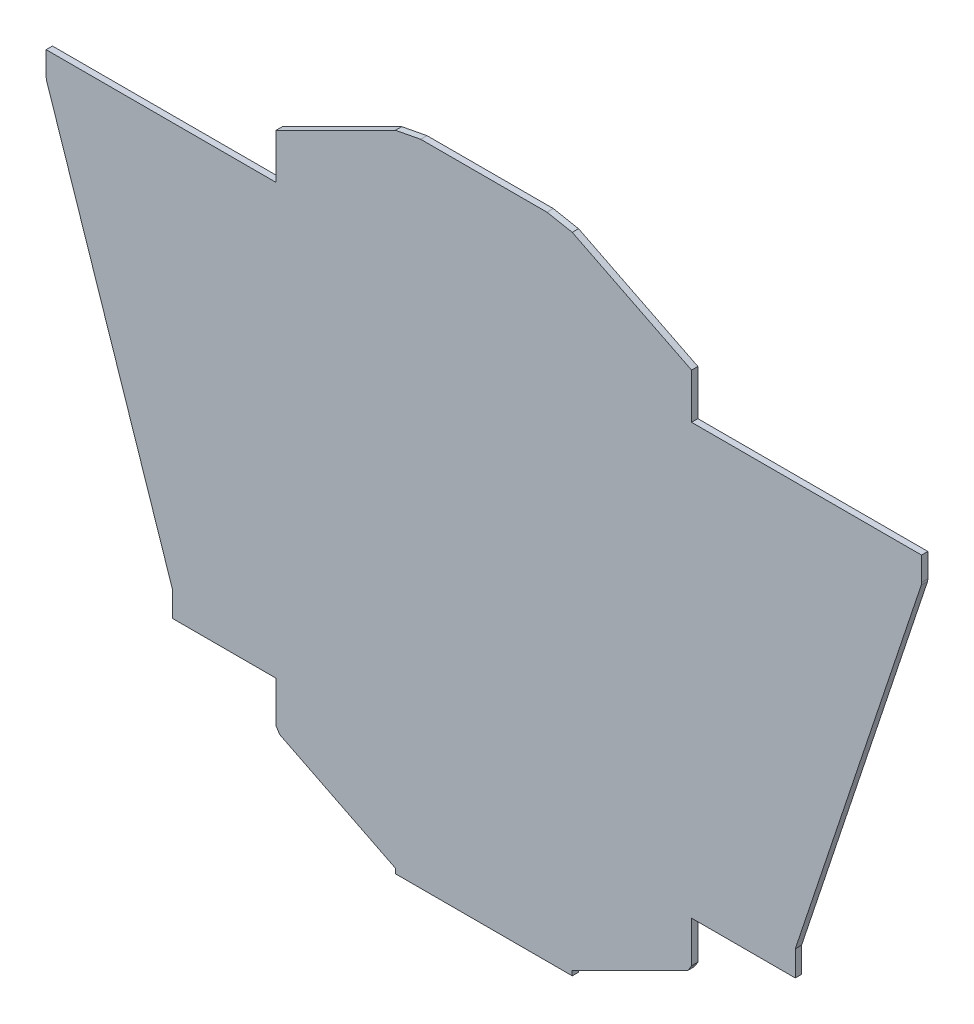
ISO-10303-21;
HEADER;
FILE_DESCRIPTION(('STEP AP214'),'2;1');
FILE_NAME('part.step','',(''),(''),'','','');
FILE_SCHEMA(('AUTOMOTIVE_DESIGN { 1 0 10303 214 1 1 1 1 }'));
ENDSEC;
DATA;
#1=APPLICATION_CONTEXT('core data for automotive mechanical design processes');
#2=APPLICATION_PROTOCOL_DEFINITION('international standard','automotive_design',2000,#1);
#3=PRODUCT_CONTEXT('',#1,'mechanical');
#4=PRODUCT('Part','Part','',(#3));
#5=PRODUCT_RELATED_PRODUCT_CATEGORY('part','',(#4));
#6=PRODUCT_DEFINITION_FORMATION('','',#4);
#7=PRODUCT_DEFINITION_CONTEXT('part definition',#1,'design');
#8=PRODUCT_DEFINITION('design','',#6,#7);
#9=PRODUCT_DEFINITION_SHAPE('','',#8);
#10=(LENGTH_UNIT() NAMED_UNIT(*) SI_UNIT(.MILLI.,.METRE.));
#11=(NAMED_UNIT(*) PLANE_ANGLE_UNIT() SI_UNIT($,.RADIAN.));
#12=(NAMED_UNIT(*) SI_UNIT($,.STERADIAN.) SOLID_ANGLE_UNIT());
#13=UNCERTAINTY_MEASURE_WITH_UNIT(LENGTH_MEASURE(1.E-05),#10,'distance_accuracy_value','');
#14=(GEOMETRIC_REPRESENTATION_CONTEXT(3) GLOBAL_UNCERTAINTY_ASSIGNED_CONTEXT((#13)) GLOBAL_UNIT_ASSIGNED_CONTEXT((#10,
#11,#12)) REPRESENTATION_CONTEXT('',''));
#15=CARTESIAN_POINT('',(0.,0.,0.));
#16=DIRECTION('',(0.,0.,1.));
#17=DIRECTION('',(1.,0.,0.));
#18=AXIS2_PLACEMENT_3D('',#15,#16,#17);
#19=CARTESIAN_POINT('',(-207.569853327196,-422.408510367575,12.7));
#20=DIRECTION('',(0.,1.,0.));
#21=DIRECTION('',(0.,0.,1.));
#22=AXIS2_PLACEMENT_3D('',#19,#20,#21);
#23=PLANE('',#22);
#24=DIRECTION('',(1.,0.,0.));
#25=VECTOR('',#24,1.);
#26=CARTESIAN_POINT('',(-207.569853327196,-422.408510367575,0.));
#27=LINE('',#26,#25);
#28=CARTESIAN_POINT('',(-245.669853327196,-422.408510367575,0.));
#29=VERTEX_POINT('',#28);
#30=CARTESIAN_POINT('',(-37.1067546299921,-422.408510367575,0.));
#31=VERTEX_POINT('',#30);
#32=EDGE_CURVE('E103',#29,#31,#27,.T.);
#33=ORIENTED_EDGE('',*,*,#32,.T.);
#34=DIRECTION('',(0.,0.,-1.));
#35=VECTOR('',#34,1.);
#36=CARTESIAN_POINT('',(-37.1067546299921,-422.408510367575,12.7));
#37=LINE('',#36,#35);
#38=CARTESIAN_POINT('',(-37.1067546299921,-422.408510367575,12.7));
#39=VERTEX_POINT('',#38);
#40=EDGE_CURVE('E11',#39,#31,#37,.T.);
#41=ORIENTED_EDGE('',*,*,#40,.F.);
#42=DIRECTION('',(1.,0.,0.));
#43=VECTOR('',#42,1.);
#44=CARTESIAN_POINT('',(-207.569853327196,-422.408510367575,12.7));
#45=LINE('',#44,#43);
#46=CARTESIAN_POINT('',(-245.669853327196,-422.408510367575,12.7));
#47=VERTEX_POINT('',#46);
#48=EDGE_CURVE('E109',#47,#39,#45,.T.);
#49=ORIENTED_EDGE('',*,*,#48,.F.);
#50=DIRECTION('',(0.,0.,-1.));
#51=VECTOR('',#50,1.);
#52=CARTESIAN_POINT('',(-245.669853327196,-422.408510367575,12.7));
#53=LINE('',#52,#51);
#54=EDGE_CURVE('E164',#47,#29,#53,.T.);
#55=ORIENTED_EDGE('',*,*,#54,.T.);
#56=EDGE_LOOP('',(#33,#41,#49,#55));
#57=FACE_BOUND('',#56,.T.);
#58=ADVANCED_FACE('F32',(#57),#23,.F.);
#59=CARTESIAN_POINT('',(-37.1067546299921,-505.433281316042,12.7));
#60=DIRECTION('',(1.,0.,0.));
#61=DIRECTION('',(0.,0.,-1.));
#62=AXIS2_PLACEMENT_3D('',#59,#60,#61);
#63=PLANE('',#62);
#64=DIRECTION('',(0.,-1.,0.));
#65=VECTOR('',#64,1.);
#66=CARTESIAN_POINT('',(-37.1067546299921,-505.433281316042,0.));
#67=LINE('',#66,#65);
#68=CARTESIAN_POINT('',(-37.1067546299921,-505.433281316042,0.));
#69=VERTEX_POINT('',#68);
#70=EDGE_CURVE('E169',#31,#69,#67,.T.);
#71=ORIENTED_EDGE('',*,*,#70,.T.);
#72=DIRECTION('',(0.,0.,-1.));
#73=VECTOR('',#72,1.);
#74=CARTESIAN_POINT('',(-37.1067546299921,-505.433281316042,12.7));
#75=LINE('',#74,#73);
#76=CARTESIAN_POINT('',(-37.1067546299921,-505.433281316042,12.7));
#77=VERTEX_POINT('',#76);
#78=EDGE_CURVE('E40',#77,#69,#75,.T.);
#79=ORIENTED_EDGE('',*,*,#78,.F.);
#80=DIRECTION('',(0.,-1.,0.));
#81=VECTOR('',#80,1.);
#82=CARTESIAN_POINT('',(-37.1067546299921,-505.433281316042,12.7));
#83=LINE('',#82,#81);
#84=EDGE_CURVE('E278',#39,#77,#83,.T.);
#85=ORIENTED_EDGE('',*,*,#84,.F.);
#86=ORIENTED_EDGE('',*,*,#40,.T.);
#87=EDGE_LOOP('',(#71,#79,#85,#86));
#88=FACE_BOUND('',#87,.T.);
#89=ADVANCED_FACE('F283',(#88),#63,.F.);
#90=CARTESIAN_POINT('',(-30.0863672928415,-516.792506641741,12.7));
#91=DIRECTION('',(0.850650808352034,0.525731112119143,0.));
#92=DIRECTION('',(-0.525731112119143,0.850650808352034,0.));
#93=AXIS2_PLACEMENT_3D('',#90,#91,#92);
#94=PLANE('',#93);
#95=DIRECTION('',(0.525731112119143,-0.850650808352034,0.));
#96=VECTOR('',#95,1.);
#97=CARTESIAN_POINT('',(-30.0863672928415,-516.792506641741,0.));
#98=LINE('',#97,#96);
#99=CARTESIAN_POINT('',(-30.0863672928415,-516.792506641741,0.));
#100=VERTEX_POINT('',#99);
#101=EDGE_CURVE('E172',#69,#100,#98,.T.);
#102=ORIENTED_EDGE('',*,*,#101,.T.);
#103=DIRECTION('',(0.,0.,-1.));
#104=VECTOR('',#103,1.);
#105=CARTESIAN_POINT('',(-30.0863672928415,-516.792506641741,12.7));
#106=LINE('',#105,#104);
#107=CARTESIAN_POINT('',(-30.0863672928415,-516.792506641741,12.7));
#108=VERTEX_POINT('',#107);
#109=EDGE_CURVE('E223',#108,#100,#106,.T.);
#110=ORIENTED_EDGE('',*,*,#109,.F.);
#111=DIRECTION('',(0.525731112119143,-0.850650808352034,0.));
#112=VECTOR('',#111,1.);
#113=CARTESIAN_POINT('',(-30.0863672928415,-516.792506641741,12.7));
#114=LINE('',#113,#112);
#115=EDGE_CURVE('E232',#77,#108,#114,.T.);
#116=ORIENTED_EDGE('',*,*,#115,.F.);
#117=ORIENTED_EDGE('',*,*,#78,.T.);
#118=EDGE_LOOP('',(#102,#110,#116,#117));
#119=FACE_BOUND('',#118,.T.);
#120=ADVANCED_FACE('F230',(#119),#94,.F.);
#121=CARTESIAN_POINT('',(202.852470695707,-633.261925636015,12.7));
#122=DIRECTION('',(0.447213595499958,0.894427190999916,0.));
#123=DIRECTION('',(-0.894427190999916,0.447213595499958,0.));
#124=AXIS2_PLACEMENT_3D('',#121,#122,#123);
#125=PLANE('',#124);
#126=DIRECTION('',(0.894427190999916,-0.447213595499958,0.));
#127=VECTOR('',#126,1.);
#128=CARTESIAN_POINT('',(202.852470695707,-633.261925636015,0.));
#129=LINE('',#128,#127);
#130=CARTESIAN_POINT('',(202.852470695707,-633.261925636015,0.));
#131=VERTEX_POINT('',#130);
#132=EDGE_CURVE('E174',#100,#131,#129,.T.);
#133=ORIENTED_EDGE('',*,*,#132,.T.);
#134=DIRECTION('',(0.,0.,-1.));
#135=VECTOR('',#134,1.);
#136=CARTESIAN_POINT('',(202.852470695707,-633.261925636015,12.7));
#137=LINE('',#136,#135);
#138=CARTESIAN_POINT('',(202.852470695707,-633.261925636015,12.7));
#139=VERTEX_POINT('',#138);
#140=EDGE_CURVE('E220',#139,#131,#137,.T.);
#141=ORIENTED_EDGE('',*,*,#140,.F.);
#142=DIRECTION('',(0.894427190999916,-0.447213595499958,0.));
#143=VECTOR('',#142,1.);
#144=CARTESIAN_POINT('',(202.852470695707,-633.261925636015,12.7));
#145=LINE('',#144,#143);
#146=EDGE_CURVE('E251',#108,#139,#145,.T.);
#147=ORIENTED_EDGE('',*,*,#146,.F.);
#148=ORIENTED_EDGE('',*,*,#109,.T.);
#149=EDGE_LOOP('',(#133,#141,#147,#148));
#150=FACE_BOUND('',#149,.T.);
#151=ADVANCED_FACE('F241',(#150),#125,.F.);
#152=CARTESIAN_POINT('',(202.852470695707,-642.963862321768,12.7));
#153=DIRECTION('',(1.,0.,0.));
#154=DIRECTION('',(0.,0.,-1.));
#155=AXIS2_PLACEMENT_3D('',#152,#153,#154);
#156=PLANE('',#155);
#157=DIRECTION('',(0.,-1.,0.));
#158=VECTOR('',#157,1.);
#159=CARTESIAN_POINT('',(202.852470695707,-642.963862321768,0.));
#160=LINE('',#159,#158);
#161=CARTESIAN_POINT('',(202.852470695707,-642.963862321768,0.));
#162=VERTEX_POINT('',#161);
#163=EDGE_CURVE('E176',#131,#162,#160,.T.);
#164=ORIENTED_EDGE('',*,*,#163,.T.);
#165=DIRECTION('',(0.,0.,-1.));
#166=VECTOR('',#165,1.);
#167=CARTESIAN_POINT('',(202.852470695707,-642.963862321768,12.7));
#168=LINE('',#167,#166);
#169=CARTESIAN_POINT('',(202.852470695707,-642.963862321768,12.7));
#170=VERTEX_POINT('',#169);
#171=EDGE_CURVE('E217',#170,#162,#168,.T.);
#172=ORIENTED_EDGE('',*,*,#171,.F.);
#173=DIRECTION('',(0.,-1.,0.));
#174=VECTOR('',#173,1.);
#175=CARTESIAN_POINT('',(202.852470695707,-642.963862321768,12.7));
#176=LINE('',#175,#174);
#177=EDGE_CURVE('E247',#139,#170,#176,.T.);
#178=ORIENTED_EDGE('',*,*,#177,.F.);
#179=ORIENTED_EDGE('',*,*,#140,.T.);
#180=EDGE_LOOP('',(#164,#172,#178,#179));
#181=FACE_BOUND('',#180,.T.);
#182=ADVANCED_FACE('F245',(#181),#156,.F.);
#183=CARTESIAN_POINT('',(380.652470695707,-642.963862321768,12.7));
#184=DIRECTION('',(0.,1.,0.));
#185=DIRECTION('',(0.,0.,1.));
#186=AXIS2_PLACEMENT_3D('',#183,#184,#185);
#187=PLANE('',#186);
#188=DIRECTION('',(1.,0.,0.));
#189=VECTOR('',#188,1.);
#190=CARTESIAN_POINT('',(380.652470695707,-642.963862321768,0.));
#191=LINE('',#190,#189);
#192=CARTESIAN_POINT('',(558.452470695707,-642.963862321768,0.));
#193=VERTEX_POINT('',#192);
#194=EDGE_CURVE('E178',#162,#193,#191,.T.);
#195=ORIENTED_EDGE('',*,*,#194,.T.);
#196=DIRECTION('',(0.,0.,-1.));
#197=VECTOR('',#196,1.);
#198=CARTESIAN_POINT('',(558.452470695707,-642.963862321768,12.7));
#199=LINE('',#198,#197);
#200=CARTESIAN_POINT('',(558.452470695707,-642.963862321768,12.7));
#201=VERTEX_POINT('',#200);
#202=EDGE_CURVE('E439',#201,#193,#199,.T.);
#203=ORIENTED_EDGE('',*,*,#202,.F.);
#204=DIRECTION('',(1.,0.,0.));
#205=VECTOR('',#204,1.);
#206=CARTESIAN_POINT('',(380.652470695707,-642.963862321768,12.7));
#207=LINE('',#206,#205);
#208=EDGE_CURVE('E250',#170,#201,#207,.T.);
#209=ORIENTED_EDGE('',*,*,#208,.F.);
#210=ORIENTED_EDGE('',*,*,#171,.T.);
#211=EDGE_LOOP('',(#195,#203,#209,#210));
#212=FACE_BOUND('',#211,.T.);
#213=ADVANCED_FACE('F295',(#212),#187,.F.);
#214=CARTESIAN_POINT('',(253.652470695707,661.746841586619,12.7));
#215=DIRECTION('',(0.,-1.,0.));
#216=DIRECTION('',(0.,0.,-1.));
#217=AXIS2_PLACEMENT_3D('',#214,#215,#216);
#218=PLANE('',#217);
#219=DIRECTION('',(-1.,0.,0.));
#220=VECTOR('',#219,1.);
#221=CARTESIAN_POINT('',(253.652470695707,661.746841586619,0.));
#222=LINE('',#221,#220);
#223=CARTESIAN_POINT('',(507.652470695707,661.746841586619,0.));
#224=VERTEX_POINT('',#223);
#225=CARTESIAN_POINT('',(253.652470695707,661.746841586619,0.));
#226=VERTEX_POINT('',#225);
#227=EDGE_CURVE('E181',#224,#226,#222,.T.);
#228=ORIENTED_EDGE('',*,*,#227,.T.);
#229=DIRECTION('',(0.,0.,-1.));
#230=VECTOR('',#229,1.);
#231=CARTESIAN_POINT('',(253.652470695707,661.746841586619,12.7));
#232=LINE('',#231,#230);
#233=CARTESIAN_POINT('',(253.652470695707,661.746841586619,12.7));
#234=VERTEX_POINT('',#233);
#235=EDGE_CURVE('E214',#234,#226,#232,.T.);
#236=ORIENTED_EDGE('',*,*,#235,.F.);
#237=DIRECTION('',(-1.,0.,0.));
#238=VECTOR('',#237,1.);
#239=CARTESIAN_POINT('',(253.652470695707,661.746841586619,12.7));
#240=LINE('',#239,#238);
#241=CARTESIAN_POINT('',(507.652470695707,661.746841586619,12.7));
#242=VERTEX_POINT('',#241);
#243=EDGE_CURVE('E253',#242,#234,#240,.T.);
#244=ORIENTED_EDGE('',*,*,#243,.F.);
#245=DIRECTION('',(0.,0.,-1.));
#246=VECTOR('',#245,1.);
#247=CARTESIAN_POINT('',(507.652470695707,661.746841586619,12.7));
#248=LINE('',#247,#246);
#249=EDGE_CURVE('E436',#242,#224,#248,.T.);
#250=ORIENTED_EDGE('',*,*,#249,.T.);
#251=EDGE_LOOP('',(#228,#236,#244,#250));
#252=FACE_BOUND('',#251,.T.);
#253=ADVANCED_FACE('F298',(#252),#218,.F.);
#254=CARTESIAN_POINT('',(202.852470695707,652.044904900867,12.7));
#255=DIRECTION('',(0.187592474085076,-0.982246946376847,0.));
#256=DIRECTION('',(0.982246946376847,0.187592474085076,0.));
#257=AXIS2_PLACEMENT_3D('',#254,#255,#256);
#258=PLANE('',#257);
#259=DIRECTION('',(-0.982246946376847,-0.187592474085076,0.));
#260=VECTOR('',#259,1.);
#261=CARTESIAN_POINT('',(202.852470695707,652.044904900867,0.));
#262=LINE('',#261,#260);
#263=CARTESIAN_POINT('',(202.852470695707,652.044904900867,0.));
#264=VERTEX_POINT('',#263);
#265=EDGE_CURVE('E183',#226,#264,#262,.T.);
#266=ORIENTED_EDGE('',*,*,#265,.T.);
#267=DIRECTION('',(0.,0.,-1.));
#268=VECTOR('',#267,1.);
#269=CARTESIAN_POINT('',(202.852470695707,652.044904900867,12.7));
#270=LINE('',#269,#268);
#271=CARTESIAN_POINT('',(202.852470695707,652.044904900867,12.7));
#272=VERTEX_POINT('',#271);
#273=EDGE_CURVE('E211',#272,#264,#270,.T.);
#274=ORIENTED_EDGE('',*,*,#273,.F.);
#275=DIRECTION('',(-0.982246946376847,-0.187592474085076,0.));
#276=VECTOR('',#275,1.);
#277=CARTESIAN_POINT('',(202.852470695707,652.044904900867,12.7));
#278=LINE('',#277,#276);
#279=EDGE_CURVE('E259',#234,#272,#278,.T.);
#280=ORIENTED_EDGE('',*,*,#279,.F.);
#281=ORIENTED_EDGE('',*,*,#235,.T.);
#282=EDGE_LOOP('',(#266,#274,#280,#281));
#283=FACE_BOUND('',#282,.T.);
#284=ADVANCED_FACE('F302',(#283),#258,.F.);
#285=CARTESIAN_POINT('',(-37.1067546299919,532.065292238017,12.7));
#286=DIRECTION('',(0.447213595499958,-0.894427190999916,0.));
#287=DIRECTION('',(0.894427190999916,0.447213595499958,0.));
#288=AXIS2_PLACEMENT_3D('',#285,#286,#287);
#289=PLANE('',#288);
#290=DIRECTION('',(-0.894427190999916,-0.447213595499958,0.));
#291=VECTOR('',#290,1.);
#292=CARTESIAN_POINT('',(-37.1067546299919,532.065292238017,0.));
#293=LINE('',#292,#291);
#294=CARTESIAN_POINT('',(-37.1067546299919,532.065292238017,0.));
#295=VERTEX_POINT('',#294);
#296=EDGE_CURVE('E185',#264,#295,#293,.T.);
#297=ORIENTED_EDGE('',*,*,#296,.T.);
#298=DIRECTION('',(0.,0.,-1.));
#299=VECTOR('',#298,1.);
#300=CARTESIAN_POINT('',(-37.1067546299919,532.065292238017,12.7));
#301=LINE('',#300,#299);
#302=CARTESIAN_POINT('',(-37.1067546299919,532.065292238017,12.7));
#303=VERTEX_POINT('',#302);
#304=EDGE_CURVE('E208',#303,#295,#301,.T.);
#305=ORIENTED_EDGE('',*,*,#304,.F.);
#306=DIRECTION('',(-0.894427190999916,-0.447213595499958,0.));
#307=VECTOR('',#306,1.);
#308=CARTESIAN_POINT('',(-37.1067546299919,532.065292238017,12.7));
#309=LINE('',#308,#307);
#310=EDGE_CURVE('E261',#272,#303,#309,.T.);
#311=ORIENTED_EDGE('',*,*,#310,.F.);
#312=ORIENTED_EDGE('',*,*,#273,.T.);
#313=EDGE_LOOP('',(#297,#305,#311,#312));
#314=FACE_BOUND('',#313,.T.);
#315=ADVANCED_FACE('F306',(#314),#289,.F.);
#316=CARTESIAN_POINT('',(-37.1067546299921,441.191489632426,12.7));
#317=DIRECTION('',(1.,0.,0.));
#318=DIRECTION('',(0.,1.,0.));
#319=AXIS2_PLACEMENT_3D('',#316,#317,#318);
#320=PLANE('',#319);
#321=DIRECTION('',(0.,-1.,0.));
#322=VECTOR('',#321,1.);
#323=CARTESIAN_POINT('',(-37.1067546299921,441.191489632426,0.));
#324=LINE('',#323,#322);
#325=CARTESIAN_POINT('',(-37.1067546299921,441.191489632426,0.));
#326=VERTEX_POINT('',#325);
#327=EDGE_CURVE('E187',#295,#326,#324,.T.);
#328=ORIENTED_EDGE('',*,*,#327,.T.);
#329=DIRECTION('',(0.,0.,-1.));
#330=VECTOR('',#329,1.);
#331=CARTESIAN_POINT('',(-37.1067546299921,441.191489632426,12.7));
#332=LINE('',#331,#330);
#333=CARTESIAN_POINT('',(-37.1067546299921,441.191489632426,12.7));
#334=VERTEX_POINT('',#333);
#335=EDGE_CURVE('E205',#334,#326,#332,.T.);
#336=ORIENTED_EDGE('',*,*,#335,.F.);
#337=DIRECTION('',(0.,-1.,0.));
#338=VECTOR('',#337,1.);
#339=CARTESIAN_POINT('',(-37.1067546299921,441.191489632426,12.7));
#340=LINE('',#339,#338);
#341=EDGE_CURVE('E263',#303,#334,#340,.T.);
#342=ORIENTED_EDGE('',*,*,#341,.F.);
#343=ORIENTED_EDGE('',*,*,#304,.T.);
#344=EDGE_LOOP('',(#328,#336,#342,#343));
#345=FACE_BOUND('',#344,.T.);
#346=ADVANCED_FACE('F310',(#345),#320,.F.);
#347=CARTESIAN_POINT('',(-461.569853327196,441.191489632426,12.7));
#348=DIRECTION('',(0.,-1.,0.));
#349=DIRECTION('',(0.,0.,-1.));
#350=AXIS2_PLACEMENT_3D('',#347,#348,#349);
#351=PLANE('',#350);
#352=DIRECTION('',(-1.,0.,0.));
#353=VECTOR('',#352,1.);
#354=CARTESIAN_POINT('',(-461.569853327196,441.191489632426,0.));
#355=LINE('',#354,#353);
#356=CARTESIAN_POINT('',(-499.669853327196,441.191489632426,0.));
#357=VERTEX_POINT('',#356);
#358=EDGE_CURVE('E190',#326,#357,#355,.T.);
#359=ORIENTED_EDGE('',*,*,#358,.T.);
#360=DIRECTION('',(0.,0.,-1.));
#361=VECTOR('',#360,1.);
#362=CARTESIAN_POINT('',(-499.669853327196,441.191489632426,12.7));
#363=LINE('',#362,#361);
#364=CARTESIAN_POINT('',(-499.669853327196,441.191489632426,12.7));
#365=VERTEX_POINT('',#364);
#366=EDGE_CURVE('E202',#365,#357,#363,.T.);
#367=ORIENTED_EDGE('',*,*,#366,.F.);
#368=DIRECTION('',(-1.,0.,0.));
#369=VECTOR('',#368,1.);
#370=CARTESIAN_POINT('',(-461.569853327196,441.191489632426,12.7));
#371=LINE('',#370,#369);
#372=EDGE_CURVE('E265',#334,#365,#371,.T.);
#373=ORIENTED_EDGE('',*,*,#372,.F.);
#374=ORIENTED_EDGE('',*,*,#335,.T.);
#375=EDGE_LOOP('',(#359,#367,#373,#374));
#376=FACE_BOUND('',#375,.T.);
#377=ADVANCED_FACE('F271',(#376),#351,.F.);
#378=CARTESIAN_POINT('',(-499.669853327196,393.865899836316,12.7));
#379=DIRECTION('',(1.,0.,0.));
#380=DIRECTION('',(0.,0.,-1.));
#381=AXIS2_PLACEMENT_3D('',#378,#379,#380);
#382=PLANE('',#381);
#383=DIRECTION('',(0.,-1.,0.));
#384=VECTOR('',#383,1.);
#385=CARTESIAN_POINT('',(-499.669853327196,393.865899836316,0.));
#386=LINE('',#385,#384);
#387=CARTESIAN_POINT('',(-499.669853327196,393.865899836316,0.));
#388=VERTEX_POINT('',#387);
#389=EDGE_CURVE('E192',#357,#388,#386,.T.);
#390=ORIENTED_EDGE('',*,*,#389,.T.);
#391=DIRECTION('',(0.,0.,-1.));
#392=VECTOR('',#391,1.);
#393=CARTESIAN_POINT('',(-499.669853327196,393.865899836316,12.7));
#394=LINE('',#393,#392);
#395=CARTESIAN_POINT('',(-499.669853327196,393.865899836316,12.7));
#396=VERTEX_POINT('',#395);
#397=EDGE_CURVE('E159',#396,#388,#394,.T.);
#398=ORIENTED_EDGE('',*,*,#397,.F.);
#399=DIRECTION('',(0.,-1.,0.));
#400=VECTOR('',#399,1.);
#401=CARTESIAN_POINT('',(-499.669853327196,393.865899836316,12.7));
#402=LINE('',#401,#400);
#403=EDGE_CURVE('E150',#365,#396,#402,.T.);
#404=ORIENTED_EDGE('',*,*,#403,.F.);
#405=ORIENTED_EDGE('',*,*,#366,.T.);
#406=EDGE_LOOP('',(#390,#398,#404,#405));
#407=FACE_BOUND('',#406,.T.);
#408=ADVANCED_FACE('F274',(#407),#382,.F.);
#409=CARTESIAN_POINT('',(-499.018131212438,388.43632328815,12.7));
#410=DIRECTION('',(0.992873097171055,0.119176394113755,0.));
#411=DIRECTION('',(-0.119176394113755,0.992873097171055,0.));
#412=AXIS2_PLACEMENT_3D('',#409,#410,#411);
#413=PLANE('',#412);
#414=DIRECTION('',(0.119176394113755,-0.992873097171055,0.));
#415=VECTOR('',#414,1.);
#416=CARTESIAN_POINT('',(-499.018131212438,388.43632328815,0.));
#417=LINE('',#416,#415);
#418=CARTESIAN_POINT('',(-499.018131212438,388.43632328815,0.));
#419=VERTEX_POINT('',#418);
#420=EDGE_CURVE('E158',#388,#419,#417,.T.);
#421=ORIENTED_EDGE('',*,*,#420,.T.);
#422=DIRECTION('',(0.,0.,-1.));
#423=VECTOR('',#422,1.);
#424=CARTESIAN_POINT('',(-499.018131212438,388.43632328815,12.7));
#425=LINE('',#424,#423);
#426=CARTESIAN_POINT('',(-499.018131212438,388.43632328815,12.7));
#427=VERTEX_POINT('',#426);
#428=EDGE_CURVE('E155',#427,#419,#425,.T.);
#429=ORIENTED_EDGE('',*,*,#428,.F.);
#430=DIRECTION('',(0.119176394113755,-0.992873097171055,0.));
#431=VECTOR('',#430,1.);
#432=CARTESIAN_POINT('',(-499.018131212438,388.43632328815,12.7));
#433=LINE('',#432,#431);
#434=EDGE_CURVE('E144',#396,#427,#433,.T.);
#435=ORIENTED_EDGE('',*,*,#434,.F.);
#436=ORIENTED_EDGE('',*,*,#397,.T.);
#437=EDGE_LOOP('',(#421,#429,#435,#436));
#438=FACE_BOUND('',#437,.T.);
#439=ADVANCED_FACE('F156',(#438),#413,.F.);
#440=CARTESIAN_POINT('',(-245.669853327196,-371.608510367575,12.7));
#441=DIRECTION('',(0.948683298050514,0.316227766016838,0.));
#442=DIRECTION('',(-0.316227766016838,0.948683298050514,0.));
#443=AXIS2_PLACEMENT_3D('',#440,#441,#442);
#444=PLANE('',#443);
#445=DIRECTION('',(0.316227766016838,-0.948683298050514,0.));
#446=VECTOR('',#445,1.);
#447=CARTESIAN_POINT('',(-245.669853327196,-371.608510367575,0.));
#448=LINE('',#447,#446);
#449=CARTESIAN_POINT('',(-245.669853327196,-371.608510367575,0.));
#450=VERTEX_POINT('',#449);
#451=EDGE_CURVE('E96',#419,#450,#448,.T.);
#452=ORIENTED_EDGE('',*,*,#451,.T.);
#453=DIRECTION('',(0.,0.,-1.));
#454=VECTOR('',#453,1.);
#455=CARTESIAN_POINT('',(-245.669853327196,-371.608510367575,12.7));
#456=LINE('',#455,#454);
#457=CARTESIAN_POINT('',(-245.669853327196,-371.608510367575,12.7));
#458=VERTEX_POINT('',#457);
#459=EDGE_CURVE('E160',#458,#450,#456,.T.);
#460=ORIENTED_EDGE('',*,*,#459,.F.);
#461=DIRECTION('',(0.316227766016838,-0.948683298050514,0.));
#462=VECTOR('',#461,1.);
#463=CARTESIAN_POINT('',(-245.669853327196,-371.608510367575,12.7));
#464=LINE('',#463,#462);
#465=EDGE_CURVE('E148',#427,#458,#464,.T.);
#466=ORIENTED_EDGE('',*,*,#465,.F.);
#467=ORIENTED_EDGE('',*,*,#428,.T.);
#468=EDGE_LOOP('',(#452,#460,#466,#467));
#469=FACE_BOUND('',#468,.T.);
#470=ADVANCED_FACE('F162',(#469),#444,.F.);
#471=CARTESIAN_POINT('',(-245.669853327196,-422.408510367575,12.7));
#472=DIRECTION('',(1.,0.,0.));
#473=DIRECTION('',(0.,0.,-1.));
#474=AXIS2_PLACEMENT_3D('',#471,#472,#473);
#475=PLANE('',#474);
#476=DIRECTION('',(0.,-1.,0.));
#477=VECTOR('',#476,1.);
#478=CARTESIAN_POINT('',(-245.669853327196,-422.408510367575,0.));
#479=LINE('',#478,#477);
#480=EDGE_CURVE('E196',#450,#29,#479,.T.);
#481=ORIENTED_EDGE('',*,*,#480,.T.);
#482=ORIENTED_EDGE('',*,*,#54,.F.);
#483=DIRECTION('',(0.,-1.,0.));
#484=VECTOR('',#483,1.);
#485=CARTESIAN_POINT('',(-245.669853327196,-422.408510367575,12.7));
#486=LINE('',#485,#484);
#487=EDGE_CURVE('E48',#458,#47,#486,.T.);
#488=ORIENTED_EDGE('',*,*,#487,.F.);
#489=ORIENTED_EDGE('',*,*,#459,.T.);
#490=EDGE_LOOP('',(#481,#482,#488,#489));
#491=FACE_BOUND('',#490,.T.);
#492=ADVANCED_FACE('F276',(#491),#475,.F.);
#493=CARTESIAN_POINT('',(0.,0.,12.7));
#494=DIRECTION('',(0.,0.,-1.));
#495=DIRECTION('',(-1.,0.,0.));
#496=AXIS2_PLACEMENT_3D('',#493,#494,#495);
#497=PLANE('',#496);
#498=ORIENTED_EDGE('',*,*,#48,.T.);
#499=ORIENTED_EDGE('',*,*,#84,.T.);
#500=ORIENTED_EDGE('',*,*,#115,.T.);
#501=ORIENTED_EDGE('',*,*,#146,.T.);
#502=ORIENTED_EDGE('',*,*,#177,.T.);
#503=ORIENTED_EDGE('',*,*,#208,.T.);
#504=DIRECTION('',(0.,-1.,0.));
#505=VECTOR('',#504,1.);
#506=CARTESIAN_POINT('',(558.452470695707,-642.963862321768,12.7));
#507=LINE('',#506,#505);
#508=CARTESIAN_POINT('',(558.452470695707,-633.261925636015,12.7));
#509=VERTEX_POINT('',#508);
#510=EDGE_CURVE('E533',#509,#201,#507,.T.);
#511=ORIENTED_EDGE('',*,*,#510,.F.);
#512=DIRECTION('',(-0.894427190999916,-0.447213595499958,0.));
#513=VECTOR('',#512,1.);
#514=CARTESIAN_POINT('',(558.452470695707,-633.261925636015,12.7));
#515=LINE('',#514,#513);
#516=CARTESIAN_POINT('',(791.391308684256,-516.792506641741,12.7));
#517=VERTEX_POINT('',#516);
#518=EDGE_CURVE('E530',#517,#509,#515,.T.);
#519=ORIENTED_EDGE('',*,*,#518,.F.);
#520=DIRECTION('',(-0.525731112119143,-0.850650808352034,0.));
#521=VECTOR('',#520,1.);
#522=CARTESIAN_POINT('',(791.391308684256,-516.792506641741,12.7));
#523=LINE('',#522,#521);
#524=CARTESIAN_POINT('',(798.411696021406,-505.433281316042,12.7));
#525=VERTEX_POINT('',#524);
#526=EDGE_CURVE('E525',#525,#517,#523,.T.);
#527=ORIENTED_EDGE('',*,*,#526,.F.);
#528=DIRECTION('',(0.,-1.,0.));
#529=VECTOR('',#528,1.);
#530=CARTESIAN_POINT('',(798.411696021406,-505.433281316042,12.7));
#531=LINE('',#530,#529);
#532=CARTESIAN_POINT('',(798.411696021406,-422.408510367575,12.7));
#533=VERTEX_POINT('',#532);
#534=EDGE_CURVE('E523',#533,#525,#531,.T.);
#535=ORIENTED_EDGE('',*,*,#534,.F.);
#536=DIRECTION('',(-1.,0.,0.));
#537=VECTOR('',#536,1.);
#538=CARTESIAN_POINT('',(968.87479471861,-422.408510367575,12.7));
#539=LINE('',#538,#537);
#540=CARTESIAN_POINT('',(1006.97479471861,-422.408510367575,12.7));
#541=VERTEX_POINT('',#540);
#542=EDGE_CURVE('E399',#541,#533,#539,.T.);
#543=ORIENTED_EDGE('',*,*,#542,.F.);
#544=DIRECTION('',(0.,-1.,0.));
#545=VECTOR('',#544,1.);
#546=CARTESIAN_POINT('',(1006.97479471861,-422.408510367575,12.7));
#547=LINE('',#546,#545);
#548=CARTESIAN_POINT('',(1006.97479471861,-371.608510367575,12.7));
#549=VERTEX_POINT('',#548);
#550=EDGE_CURVE('E418',#549,#541,#547,.T.);
#551=ORIENTED_EDGE('',*,*,#550,.F.);
#552=DIRECTION('',(-0.316227766016838,-0.948683298050514,0.));
#553=VECTOR('',#552,1.);
#554=CARTESIAN_POINT('',(1006.97479471861,-371.608510367575,12.7));
#555=LINE('',#554,#553);
#556=CARTESIAN_POINT('',(1260.32307260385,388.43632328815,12.7));
#557=VERTEX_POINT('',#556);
#558=EDGE_CURVE('E406',#557,#549,#555,.T.);
#559=ORIENTED_EDGE('',*,*,#558,.F.);
#560=DIRECTION('',(-0.119176394113755,-0.992873097171055,0.));
#561=VECTOR('',#560,1.);
#562=CARTESIAN_POINT('',(1260.32307260385,388.43632328815,12.7));
#563=LINE('',#562,#561);
#564=CARTESIAN_POINT('',(1260.97479471861,393.865899836316,12.7));
#565=VERTEX_POINT('',#564);
#566=EDGE_CURVE('E512',#565,#557,#563,.T.);
#567=ORIENTED_EDGE('',*,*,#566,.F.);
#568=DIRECTION('',(0.,-1.,0.));
#569=VECTOR('',#568,1.);
#570=CARTESIAN_POINT('',(1260.97479471861,393.865899836316,12.7));
#571=LINE('',#570,#569);
#572=CARTESIAN_POINT('',(1260.97479471861,441.191489632426,12.7));
#573=VERTEX_POINT('',#572);
#574=EDGE_CURVE('E509',#573,#565,#571,.T.);
#575=ORIENTED_EDGE('',*,*,#574,.F.);
#576=DIRECTION('',(1.,0.,0.));
#577=VECTOR('',#576,1.);
#578=CARTESIAN_POINT('',(1222.87479471861,441.191489632426,12.7));
#579=LINE('',#578,#577);
#580=CARTESIAN_POINT('',(798.411696021406,441.191489632426,12.7));
#581=VERTEX_POINT('',#580);
#582=EDGE_CURVE('E502',#581,#573,#579,.T.);
#583=ORIENTED_EDGE('',*,*,#582,.F.);
#584=DIRECTION('',(0.,-1.,0.));
#585=VECTOR('',#584,1.);
#586=CARTESIAN_POINT('',(798.411696021406,441.191489632426,12.7));
#587=LINE('',#586,#585);
#588=CARTESIAN_POINT('',(798.411696021406,532.065292238017,12.7));
#589=VERTEX_POINT('',#588);
#590=EDGE_CURVE('E510',#589,#581,#587,.T.);
#591=ORIENTED_EDGE('',*,*,#590,.F.);
#592=DIRECTION('',(0.894427190999916,-0.447213595499958,0.));
#593=VECTOR('',#592,1.);
#594=CARTESIAN_POINT('',(798.411696021406,532.065292238017,12.7));
#595=LINE('',#594,#593);
#596=CARTESIAN_POINT('',(558.452470695707,652.044904900867,12.7));
#597=VERTEX_POINT('',#596);
#598=EDGE_CURVE('E514',#597,#589,#595,.T.);
#599=ORIENTED_EDGE('',*,*,#598,.F.);
#600=DIRECTION('',(0.982246946376847,-0.187592474085076,0.));
#601=VECTOR('',#600,1.);
#602=CARTESIAN_POINT('',(558.452470695707,652.044904900867,12.7));
#603=LINE('',#602,#601);
#604=EDGE_CURVE('E536',#242,#597,#603,.T.);
#605=ORIENTED_EDGE('',*,*,#604,.F.);
#606=ORIENTED_EDGE('',*,*,#243,.T.);
#607=ORIENTED_EDGE('',*,*,#279,.T.);
#608=ORIENTED_EDGE('',*,*,#310,.T.);
#609=ORIENTED_EDGE('',*,*,#341,.T.);
#610=ORIENTED_EDGE('',*,*,#372,.T.);
#611=ORIENTED_EDGE('',*,*,#403,.T.);
#612=ORIENTED_EDGE('',*,*,#434,.T.);
#613=ORIENTED_EDGE('',*,*,#465,.T.);
#614=ORIENTED_EDGE('',*,*,#487,.T.);
#615=EDGE_LOOP('',(#498,#499,#500,#501,#502,#503,#511,#519,#527,#535,#543,#551,#559,#567,#575,
#583,#591,#599,#605,#606,#607,#608,#609,#610,#611,#612,#613,#614));
#616=FACE_BOUND('',#615,.T.);
#617=ADVANCED_FACE('F146',(#616),#497,.F.);
#618=CARTESIAN_POINT('',(0.,0.,0.));
#619=DIRECTION('',(0.,0.,-1.));
#620=DIRECTION('',(-1.,0.,0.));
#621=AXIS2_PLACEMENT_3D('',#618,#619,#620);
#622=PLANE('',#621);
#623=ORIENTED_EDGE('',*,*,#32,.F.);
#624=ORIENTED_EDGE('',*,*,#480,.F.);
#625=ORIENTED_EDGE('',*,*,#451,.F.);
#626=ORIENTED_EDGE('',*,*,#420,.F.);
#627=ORIENTED_EDGE('',*,*,#389,.F.);
#628=ORIENTED_EDGE('',*,*,#358,.F.);
#629=ORIENTED_EDGE('',*,*,#327,.F.);
#630=ORIENTED_EDGE('',*,*,#296,.F.);
#631=ORIENTED_EDGE('',*,*,#265,.F.);
#632=ORIENTED_EDGE('',*,*,#227,.F.);
#633=DIRECTION('',(0.982246946376847,-0.187592474085076,0.));
#634=VECTOR('',#633,1.);
#635=CARTESIAN_POINT('',(558.452470695707,652.044904900867,0.));
#636=LINE('',#635,#634);
#637=CARTESIAN_POINT('',(558.452470695707,652.044904900867,0.));
#638=VERTEX_POINT('',#637);
#639=EDGE_CURVE('E477',#224,#638,#636,.T.);
#640=ORIENTED_EDGE('',*,*,#639,.T.);
#641=DIRECTION('',(0.894427190999916,-0.447213595499958,0.));
#642=VECTOR('',#641,1.);
#643=CARTESIAN_POINT('',(798.411696021406,532.065292238017,0.));
#644=LINE('',#643,#642);
#645=CARTESIAN_POINT('',(798.411696021406,532.065292238017,0.));
#646=VERTEX_POINT('',#645);
#647=EDGE_CURVE('E480',#638,#646,#644,.T.);
#648=ORIENTED_EDGE('',*,*,#647,.T.);
#649=DIRECTION('',(0.,-1.,0.));
#650=VECTOR('',#649,1.);
#651=CARTESIAN_POINT('',(798.411696021406,441.191489632426,0.));
#652=LINE('',#651,#650);
#653=CARTESIAN_POINT('',(798.411696021406,441.191489632426,0.));
#654=VERTEX_POINT('',#653);
#655=EDGE_CURVE('E483',#646,#654,#652,.T.);
#656=ORIENTED_EDGE('',*,*,#655,.T.);
#657=DIRECTION('',(1.,0.,0.));
#658=VECTOR('',#657,1.);
#659=CARTESIAN_POINT('',(1222.87479471861,441.191489632426,0.));
#660=LINE('',#659,#658);
#661=CARTESIAN_POINT('',(1260.97479471861,441.191489632426,0.));
#662=VERTEX_POINT('',#661);
#663=EDGE_CURVE('E486',#654,#662,#660,.T.);
#664=ORIENTED_EDGE('',*,*,#663,.T.);
#665=DIRECTION('',(0.,-1.,0.));
#666=VECTOR('',#665,1.);
#667=CARTESIAN_POINT('',(1260.97479471861,393.865899836316,0.));
#668=LINE('',#667,#666);
#669=CARTESIAN_POINT('',(1260.97479471861,393.865899836316,0.));
#670=VERTEX_POINT('',#669);
#671=EDGE_CURVE('E414',#662,#670,#668,.T.);
#672=ORIENTED_EDGE('',*,*,#671,.T.);
#673=DIRECTION('',(-0.119176394113755,-0.992873097171055,0.));
#674=VECTOR('',#673,1.);
#675=CARTESIAN_POINT('',(1260.32307260385,388.43632328815,0.));
#676=LINE('',#675,#674);
#677=CARTESIAN_POINT('',(1260.32307260385,388.43632328815,0.));
#678=VERTEX_POINT('',#677);
#679=EDGE_CURVE('E412',#670,#678,#676,.T.);
#680=ORIENTED_EDGE('',*,*,#679,.T.);
#681=DIRECTION('',(-0.316227766016838,-0.948683298050514,0.));
#682=VECTOR('',#681,1.);
#683=CARTESIAN_POINT('',(1006.97479471861,-371.608510367575,0.));
#684=LINE('',#683,#682);
#685=CARTESIAN_POINT('',(1006.97479471861,-371.608510367575,0.));
#686=VERTEX_POINT('',#685);
#687=EDGE_CURVE('E400',#678,#686,#684,.T.);
#688=ORIENTED_EDGE('',*,*,#687,.T.);
#689=DIRECTION('',(0.,-1.,0.));
#690=VECTOR('',#689,1.);
#691=CARTESIAN_POINT('',(1006.97479471861,-422.408510367575,0.));
#692=LINE('',#691,#690);
#693=CARTESIAN_POINT('',(1006.97479471861,-422.408510367575,0.));
#694=VERTEX_POINT('',#693);
#695=EDGE_CURVE('E387',#686,#694,#692,.T.);
#696=ORIENTED_EDGE('',*,*,#695,.T.);
#697=DIRECTION('',(-1.,0.,0.));
#698=VECTOR('',#697,1.);
#699=CARTESIAN_POINT('',(968.87479471861,-422.408510367575,0.));
#700=LINE('',#699,#698);
#701=CARTESIAN_POINT('',(798.411696021406,-422.408510367575,0.));
#702=VERTEX_POINT('',#701);
#703=EDGE_CURVE('E458',#694,#702,#700,.T.);
#704=ORIENTED_EDGE('',*,*,#703,.T.);
#705=DIRECTION('',(0.,-1.,0.));
#706=VECTOR('',#705,1.);
#707=CARTESIAN_POINT('',(798.411696021406,-505.433281316042,0.));
#708=LINE('',#707,#706);
#709=CARTESIAN_POINT('',(798.411696021406,-505.433281316042,0.));
#710=VERTEX_POINT('',#709);
#711=EDGE_CURVE('E463',#702,#710,#708,.T.);
#712=ORIENTED_EDGE('',*,*,#711,.T.);
#713=DIRECTION('',(-0.525731112119143,-0.850650808352034,0.));
#714=VECTOR('',#713,1.);
#715=CARTESIAN_POINT('',(791.391308684256,-516.792506641741,0.));
#716=LINE('',#715,#714);
#717=CARTESIAN_POINT('',(791.391308684256,-516.792506641741,0.));
#718=VERTEX_POINT('',#717);
#719=EDGE_CURVE('E465',#710,#718,#716,.T.);
#720=ORIENTED_EDGE('',*,*,#719,.T.);
#721=DIRECTION('',(-0.894427190999916,-0.447213595499958,0.));
#722=VECTOR('',#721,1.);
#723=CARTESIAN_POINT('',(558.452470695707,-633.261925636015,0.));
#724=LINE('',#723,#722);
#725=CARTESIAN_POINT('',(558.452470695707,-633.261925636015,0.));
#726=VERTEX_POINT('',#725);
#727=EDGE_CURVE('E471',#718,#726,#724,.T.);
#728=ORIENTED_EDGE('',*,*,#727,.T.);
#729=DIRECTION('',(0.,-1.,0.));
#730=VECTOR('',#729,1.);
#731=CARTESIAN_POINT('',(558.452470695707,-642.963862321768,0.));
#732=LINE('',#731,#730);
#733=EDGE_CURVE('E474',#726,#193,#732,.T.);
#734=ORIENTED_EDGE('',*,*,#733,.T.);
#735=ORIENTED_EDGE('',*,*,#194,.F.);
#736=ORIENTED_EDGE('',*,*,#163,.F.);
#737=ORIENTED_EDGE('',*,*,#132,.F.);
#738=ORIENTED_EDGE('',*,*,#101,.F.);
#739=ORIENTED_EDGE('',*,*,#70,.F.);
#740=EDGE_LOOP('',(#623,#624,#625,#626,#627,#628,#629,#630,#631,#632,#640,#648,#656,#664,#672,
#680,#688,#696,#704,#712,#720,#728,#734,#735,#736,#737,#738,#739));
#741=FACE_BOUND('',#740,.T.);
#742=ADVANCED_FACE('F236',(#741),#622,.T.);
#743=CARTESIAN_POINT('',(968.87479471861,-422.408510367575,12.7));
#744=DIRECTION('',(0.,1.,0.));
#745=DIRECTION('',(0.,0.,1.));
#746=AXIS2_PLACEMENT_3D('',#743,#744,#745);
#747=PLANE('',#746);
#748=ORIENTED_EDGE('',*,*,#703,.F.);
#749=DIRECTION('',(0.,0.,-1.));
#750=VECTOR('',#749,1.);
#751=CARTESIAN_POINT('',(1006.97479471861,-422.408510367575,12.7));
#752=LINE('',#751,#750);
#753=EDGE_CURVE('E394',#541,#694,#752,.T.);
#754=ORIENTED_EDGE('',*,*,#753,.F.);
#755=ORIENTED_EDGE('',*,*,#542,.T.);
#756=DIRECTION('',(0.,0.,-1.));
#757=VECTOR('',#756,1.);
#758=CARTESIAN_POINT('',(798.411696021406,-422.408510367575,12.7));
#759=LINE('',#758,#757);
#760=EDGE_CURVE('E170',#533,#702,#759,.T.);
#761=ORIENTED_EDGE('',*,*,#760,.T.);
#762=EDGE_LOOP('',(#748,#754,#755,#761));
#763=FACE_BOUND('',#762,.T.);
#764=ADVANCED_FACE('F327',(#763),#747,.F.);
#765=CARTESIAN_POINT('',(798.411696021406,-505.433281316042,12.7));
#766=DIRECTION('',(-1.,0.,0.));
#767=DIRECTION('',(0.,0.,-1.));
#768=AXIS2_PLACEMENT_3D('',#765,#766,#767);
#769=PLANE('',#768);
#770=ORIENTED_EDGE('',*,*,#711,.F.);
#771=ORIENTED_EDGE('',*,*,#760,.F.);
#772=ORIENTED_EDGE('',*,*,#534,.T.);
#773=DIRECTION('',(0.,0.,-1.));
#774=VECTOR('',#773,1.);
#775=CARTESIAN_POINT('',(798.411696021406,-505.433281316042,12.7));
#776=LINE('',#775,#774);
#777=EDGE_CURVE('E447',#525,#710,#776,.T.);
#778=ORIENTED_EDGE('',*,*,#777,.T.);
#779=EDGE_LOOP('',(#770,#771,#772,#778));
#780=FACE_BOUND('',#779,.T.);
#781=ADVANCED_FACE('F332',(#780),#769,.F.);
#782=CARTESIAN_POINT('',(791.391308684256,-516.792506641741,12.7));
#783=DIRECTION('',(-0.850650808352034,0.525731112119143,0.));
#784=DIRECTION('',(0.525731112119143,0.850650808352034,0.));
#785=AXIS2_PLACEMENT_3D('',#782,#783,#784);
#786=PLANE('',#785);
#787=ORIENTED_EDGE('',*,*,#719,.F.);
#788=ORIENTED_EDGE('',*,*,#777,.F.);
#789=ORIENTED_EDGE('',*,*,#526,.T.);
#790=DIRECTION('',(0.,0.,-1.));
#791=VECTOR('',#790,1.);
#792=CARTESIAN_POINT('',(791.391308684256,-516.792506641741,12.7));
#793=LINE('',#792,#791);
#794=EDGE_CURVE('E445',#517,#718,#793,.T.);
#795=ORIENTED_EDGE('',*,*,#794,.T.);
#796=EDGE_LOOP('',(#787,#788,#789,#795));
#797=FACE_BOUND('',#796,.T.);
#798=ADVANCED_FACE('F336',(#797),#786,.F.);
#799=CARTESIAN_POINT('',(558.452470695707,-633.261925636015,12.7));
#800=DIRECTION('',(-0.447213595499958,0.894427190999916,0.));
#801=DIRECTION('',(0.894427190999916,0.447213595499958,0.));
#802=AXIS2_PLACEMENT_3D('',#799,#800,#801);
#803=PLANE('',#802);
#804=ORIENTED_EDGE('',*,*,#727,.F.);
#805=ORIENTED_EDGE('',*,*,#794,.F.);
#806=ORIENTED_EDGE('',*,*,#518,.T.);
#807=DIRECTION('',(0.,0.,-1.));
#808=VECTOR('',#807,1.);
#809=CARTESIAN_POINT('',(558.452470695707,-633.261925636015,12.7));
#810=LINE('',#809,#808);
#811=EDGE_CURVE('E442',#509,#726,#810,.T.);
#812=ORIENTED_EDGE('',*,*,#811,.T.);
#813=EDGE_LOOP('',(#804,#805,#806,#812));
#814=FACE_BOUND('',#813,.T.);
#815=ADVANCED_FACE('F340',(#814),#803,.F.);
#816=CARTESIAN_POINT('',(558.452470695707,-642.963862321768,12.7));
#817=DIRECTION('',(-1.,0.,0.));
#818=DIRECTION('',(0.,0.,-1.));
#819=AXIS2_PLACEMENT_3D('',#816,#817,#818);
#820=PLANE('',#819);
#821=ORIENTED_EDGE('',*,*,#733,.F.);
#822=ORIENTED_EDGE('',*,*,#811,.F.);
#823=ORIENTED_EDGE('',*,*,#510,.T.);
#824=ORIENTED_EDGE('',*,*,#202,.T.);
#825=EDGE_LOOP('',(#821,#822,#823,#824));
#826=FACE_BOUND('',#825,.T.);
#827=ADVANCED_FACE('F344',(#826),#820,.F.);
#828=CARTESIAN_POINT('',(558.452470695707,652.044904900867,12.7));
#829=DIRECTION('',(-0.187592474085076,-0.982246946376847,0.));
#830=DIRECTION('',(-0.982246946376847,0.187592474085076,0.));
#831=AXIS2_PLACEMENT_3D('',#828,#829,#830);
#832=PLANE('',#831);
#833=ORIENTED_EDGE('',*,*,#639,.F.);
#834=ORIENTED_EDGE('',*,*,#249,.F.);
#835=ORIENTED_EDGE('',*,*,#604,.T.);
#836=DIRECTION('',(0.,0.,-1.));
#837=VECTOR('',#836,1.);
#838=CARTESIAN_POINT('',(558.452470695707,652.044904900867,12.7));
#839=LINE('',#838,#837);
#840=EDGE_CURVE('E433',#597,#638,#839,.T.);
#841=ORIENTED_EDGE('',*,*,#840,.T.);
#842=EDGE_LOOP('',(#833,#834,#835,#841));
#843=FACE_BOUND('',#842,.T.);
#844=ADVANCED_FACE('F348',(#843),#832,.F.);
#845=CARTESIAN_POINT('',(798.411696021406,532.065292238017,12.7));
#846=DIRECTION('',(-0.447213595499958,-0.894427190999916,0.));
#847=DIRECTION('',(-0.894427190999916,0.447213595499958,0.));
#848=AXIS2_PLACEMENT_3D('',#845,#846,#847);
#849=PLANE('',#848);
#850=ORIENTED_EDGE('',*,*,#647,.F.);
#851=ORIENTED_EDGE('',*,*,#840,.F.);
#852=ORIENTED_EDGE('',*,*,#598,.T.);
#853=DIRECTION('',(0.,0.,-1.));
#854=VECTOR('',#853,1.);
#855=CARTESIAN_POINT('',(798.411696021406,532.065292238017,12.7));
#856=LINE('',#855,#854);
#857=EDGE_CURVE('E430',#589,#646,#856,.T.);
#858=ORIENTED_EDGE('',*,*,#857,.T.);
#859=EDGE_LOOP('',(#850,#851,#852,#858));
#860=FACE_BOUND('',#859,.T.);
#861=ADVANCED_FACE('F352',(#860),#849,.F.);
#862=CARTESIAN_POINT('',(798.411696021406,441.191489632426,12.7));
#863=DIRECTION('',(-1.,0.,0.));
#864=DIRECTION('',(0.,1.,0.));
#865=AXIS2_PLACEMENT_3D('',#862,#863,#864);
#866=PLANE('',#865);
#867=ORIENTED_EDGE('',*,*,#655,.F.);
#868=ORIENTED_EDGE('',*,*,#857,.F.);
#869=ORIENTED_EDGE('',*,*,#590,.T.);
#870=DIRECTION('',(0.,0.,-1.));
#871=VECTOR('',#870,1.);
#872=CARTESIAN_POINT('',(798.411696021406,441.191489632426,12.7));
#873=LINE('',#872,#871);
#874=EDGE_CURVE('E427',#581,#654,#873,.T.);
#875=ORIENTED_EDGE('',*,*,#874,.T.);
#876=EDGE_LOOP('',(#867,#868,#869,#875));
#877=FACE_BOUND('',#876,.T.);
#878=ADVANCED_FACE('F356',(#877),#866,.F.);
#879=CARTESIAN_POINT('',(1222.87479471861,441.191489632426,12.7));
#880=DIRECTION('',(0.,-1.,0.));
#881=DIRECTION('',(0.,0.,-1.));
#882=AXIS2_PLACEMENT_3D('',#879,#880,#881);
#883=PLANE('',#882);
#884=ORIENTED_EDGE('',*,*,#663,.F.);
#885=ORIENTED_EDGE('',*,*,#874,.F.);
#886=ORIENTED_EDGE('',*,*,#582,.T.);
#887=DIRECTION('',(0.,0.,-1.));
#888=VECTOR('',#887,1.);
#889=CARTESIAN_POINT('',(1260.97479471861,441.191489632426,12.7));
#890=LINE('',#889,#888);
#891=EDGE_CURVE('E424',#573,#662,#890,.T.);
#892=ORIENTED_EDGE('',*,*,#891,.T.);
#893=EDGE_LOOP('',(#884,#885,#886,#892));
#894=FACE_BOUND('',#893,.T.);
#895=ADVANCED_FACE('F360',(#894),#883,.F.);
#896=CARTESIAN_POINT('',(1260.97479471861,393.865899836316,12.7));
#897=DIRECTION('',(-1.,0.,0.));
#898=DIRECTION('',(0.,0.,-1.));
#899=AXIS2_PLACEMENT_3D('',#896,#897,#898);
#900=PLANE('',#899);
#901=ORIENTED_EDGE('',*,*,#671,.F.);
#902=ORIENTED_EDGE('',*,*,#891,.F.);
#903=ORIENTED_EDGE('',*,*,#574,.T.);
#904=DIRECTION('',(0.,0.,-1.));
#905=VECTOR('',#904,1.);
#906=CARTESIAN_POINT('',(1260.97479471861,393.865899836316,12.7));
#907=LINE('',#906,#905);
#908=EDGE_CURVE('E421',#565,#670,#907,.T.);
#909=ORIENTED_EDGE('',*,*,#908,.T.);
#910=EDGE_LOOP('',(#901,#902,#903,#909));
#911=FACE_BOUND('',#910,.T.);
#912=ADVANCED_FACE('F364',(#911),#900,.F.);
#913=CARTESIAN_POINT('',(1260.32307260385,388.43632328815,12.7));
#914=DIRECTION('',(-0.992873097171055,0.119176394113755,0.));
#915=DIRECTION('',(0.119176394113755,0.992873097171055,0.));
#916=AXIS2_PLACEMENT_3D('',#913,#914,#915);
#917=PLANE('',#916);
#918=ORIENTED_EDGE('',*,*,#679,.F.);
#919=ORIENTED_EDGE('',*,*,#908,.F.);
#920=ORIENTED_EDGE('',*,*,#566,.T.);
#921=DIRECTION('',(0.,0.,-1.));
#922=VECTOR('',#921,1.);
#923=CARTESIAN_POINT('',(1260.32307260385,388.43632328815,12.7));
#924=LINE('',#923,#922);
#925=EDGE_CURVE('E407',#557,#678,#924,.T.);
#926=ORIENTED_EDGE('',*,*,#925,.T.);
#927=EDGE_LOOP('',(#918,#919,#920,#926));
#928=FACE_BOUND('',#927,.T.);
#929=ADVANCED_FACE('F368',(#928),#917,.F.);
#930=CARTESIAN_POINT('',(1006.97479471861,-371.608510367575,12.7));
#931=DIRECTION('',(-0.948683298050514,0.316227766016838,0.));
#932=DIRECTION('',(0.316227766016838,0.948683298050514,0.));
#933=AXIS2_PLACEMENT_3D('',#930,#931,#932);
#934=PLANE('',#933);
#935=ORIENTED_EDGE('',*,*,#687,.F.);
#936=ORIENTED_EDGE('',*,*,#925,.F.);
#937=ORIENTED_EDGE('',*,*,#558,.T.);
#938=DIRECTION('',(0.,0.,-1.));
#939=VECTOR('',#938,1.);
#940=CARTESIAN_POINT('',(1006.97479471861,-371.608510367575,12.7));
#941=LINE('',#940,#939);
#942=EDGE_CURVE('E391',#549,#686,#941,.T.);
#943=ORIENTED_EDGE('',*,*,#942,.T.);
#944=EDGE_LOOP('',(#935,#936,#937,#943));
#945=FACE_BOUND('',#944,.T.);
#946=ADVANCED_FACE('F372',(#945),#934,.F.);
#947=CARTESIAN_POINT('',(1006.97479471861,-422.408510367575,12.7));
#948=DIRECTION('',(-1.,0.,0.));
#949=DIRECTION('',(0.,0.,-1.));
#950=AXIS2_PLACEMENT_3D('',#947,#948,#949);
#951=PLANE('',#950);
#952=ORIENTED_EDGE('',*,*,#695,.F.);
#953=ORIENTED_EDGE('',*,*,#942,.F.);
#954=ORIENTED_EDGE('',*,*,#550,.T.);
#955=ORIENTED_EDGE('',*,*,#753,.T.);
#956=EDGE_LOOP('',(#952,#953,#954,#955));
#957=FACE_BOUND('',#956,.T.);
#958=ADVANCED_FACE('F376',(#957),#951,.F.);
#959=CLOSED_SHELL('',(#58,#89,#120,#151,#182,#213,#253,#284,#315,#346,#377,#408,#439,#470,#492,
#617,#742,#764,#781,#798,#815,#827,#844,#861,#878,#895,#912,#929,#946,#958));
#960=MANIFOLD_SOLID_BREP('B2',#959);
#961=ADVANCED_BREP_SHAPE_REPRESENTATION('',(#18,#960),#14);
#962=SHAPE_DEFINITION_REPRESENTATION(#9,#961);
ENDSEC;
END-ISO-10303-21;
